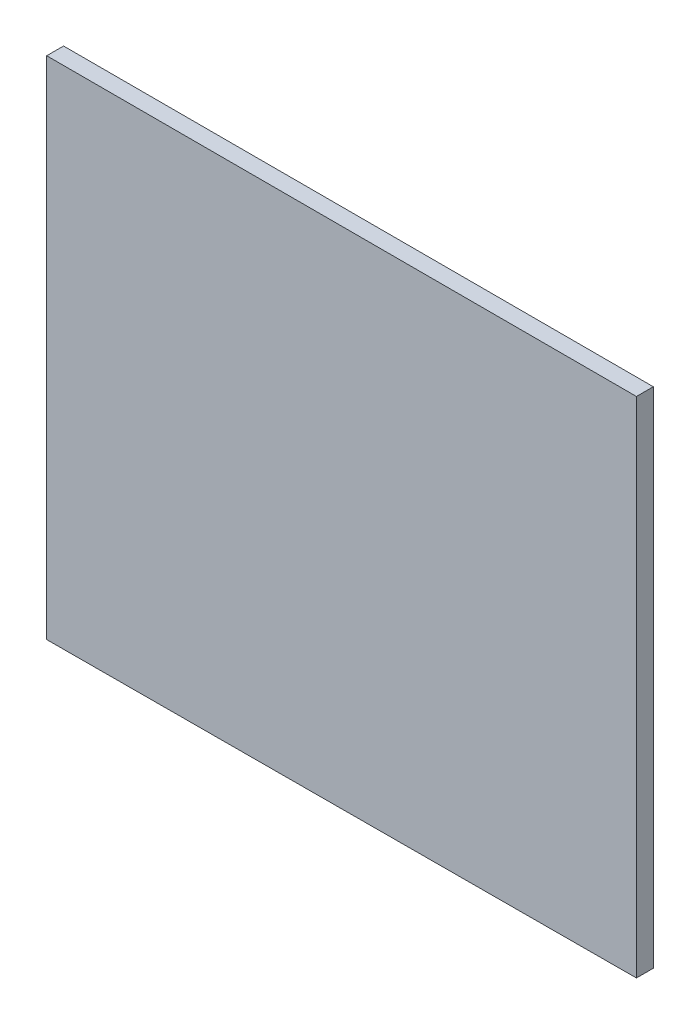
ISO-10303-21;
HEADER;
FILE_DESCRIPTION(('STEP AP214'),'2;1');
FILE_NAME('part.step','',(''),(''),'','','');
FILE_SCHEMA(('AUTOMOTIVE_DESIGN { 1 0 10303 214 1 1 1 1 }'));
ENDSEC;
DATA;
#1=APPLICATION_CONTEXT('core data for automotive mechanical design processes');
#2=APPLICATION_PROTOCOL_DEFINITION('international standard','automotive_design',2000,#1);
#3=PRODUCT_CONTEXT('',#1,'mechanical');
#4=PRODUCT('Part','Part','',(#3));
#5=PRODUCT_RELATED_PRODUCT_CATEGORY('part','',(#4));
#6=PRODUCT_DEFINITION_FORMATION('','',#4);
#7=PRODUCT_DEFINITION_CONTEXT('part definition',#1,'design');
#8=PRODUCT_DEFINITION('design','',#6,#7);
#9=PRODUCT_DEFINITION_SHAPE('','',#8);
#10=(LENGTH_UNIT() NAMED_UNIT(*) SI_UNIT(.MILLI.,.METRE.));
#11=(NAMED_UNIT(*) PLANE_ANGLE_UNIT() SI_UNIT($,.RADIAN.));
#12=(NAMED_UNIT(*) SI_UNIT($,.STERADIAN.) SOLID_ANGLE_UNIT());
#13=UNCERTAINTY_MEASURE_WITH_UNIT(LENGTH_MEASURE(1.E-05),#10,'distance_accuracy_value','');
#14=(GEOMETRIC_REPRESENTATION_CONTEXT(3) GLOBAL_UNCERTAINTY_ASSIGNED_CONTEXT((#13)) GLOBAL_UNIT_ASSIGNED_CONTEXT((#10,
#11,#12)) REPRESENTATION_CONTEXT('',''));
#15=CARTESIAN_POINT('',(0.,0.,0.));
#16=DIRECTION('',(0.,0.,1.));
#17=DIRECTION('',(1.,0.,0.));
#18=AXIS2_PLACEMENT_3D('',#15,#16,#17);
#19=CARTESIAN_POINT('',(42.3997334253943,28.7357408736981,0.1));
#20=DIRECTION('',(-1.,0.,0.));
#21=DIRECTION('',(0.,0.,1.));
#22=AXIS2_PLACEMENT_3D('',#19,#20,#21);
#23=PLANE('',#22);
#24=DIRECTION('',(0.,1.,0.));
#25=VECTOR('',#24,1.);
#26=CARTESIAN_POINT('',(42.3997334253943,28.7357408736981,0.));
#27=LINE('',#26,#25);
#28=CARTESIAN_POINT('',(42.3997334253943,28.7357408736981,0.));
#29=VERTEX_POINT('',#28);
#30=CARTESIAN_POINT('',(42.3997334253943,31.7237007621709,0.));
#31=VERTEX_POINT('',#30);
#32=EDGE_CURVE('E96',#29,#31,#27,.T.);
#33=ORIENTED_EDGE('',*,*,#32,.T.);
#34=DIRECTION('',(0.,0.,-1.));
#35=VECTOR('',#34,1.);
#36=CARTESIAN_POINT('',(42.3997334253943,31.7237007621709,0.1));
#37=LINE('',#36,#35);
#38=CARTESIAN_POINT('',(42.3997334253943,31.7237007621709,0.1));
#39=VERTEX_POINT('',#38);
#40=EDGE_CURVE('E11',#39,#31,#37,.T.);
#41=ORIENTED_EDGE('',*,*,#40,.F.);
#42=DIRECTION('',(0.,1.,0.));
#43=VECTOR('',#42,1.);
#44=CARTESIAN_POINT('',(42.3997334253943,28.7357408736981,0.1));
#45=LINE('',#44,#43);
#46=CARTESIAN_POINT('',(42.3997334253943,28.7357408736981,0.1));
#47=VERTEX_POINT('',#46);
#48=EDGE_CURVE('E84',#47,#39,#45,.T.);
#49=ORIENTED_EDGE('',*,*,#48,.F.);
#50=DIRECTION('',(0.,0.,-1.));
#51=VECTOR('',#50,1.);
#52=CARTESIAN_POINT('',(42.3997334253943,28.7357408736981,0.1));
#53=LINE('',#52,#51);
#54=EDGE_CURVE('E92',#47,#29,#53,.T.);
#55=ORIENTED_EDGE('',*,*,#54,.T.);
#56=EDGE_LOOP('',(#33,#41,#49,#55));
#57=FACE_BOUND('',#56,.T.);
#58=ADVANCED_FACE('F33',(#57),#23,.F.);
#59=CARTESIAN_POINT('',(42.3997334253943,31.7237007621709,0.1));
#60=DIRECTION('',(-0.000366482877308184,-0.999999932845148,0.));
#61=DIRECTION('',(0.999999932845148,-0.000366482877308184,0.));
#62=AXIS2_PLACEMENT_3D('',#59,#60,#61);
#63=PLANE('',#62);
#64=DIRECTION('',(-0.999999932845148,0.000366482877308184,0.));
#65=VECTOR('',#64,1.);
#66=CARTESIAN_POINT('',(42.3997334253943,31.7237007621709,0.));
#67=LINE('',#66,#65);
#68=CARTESIAN_POINT('',(38.9009908822222,31.7249829914912,0.));
#69=VERTEX_POINT('',#68);
#70=EDGE_CURVE('E88',#31,#69,#67,.T.);
#71=ORIENTED_EDGE('',*,*,#70,.T.);
#72=DIRECTION('',(0.,0.,-1.));
#73=VECTOR('',#72,1.);
#74=CARTESIAN_POINT('',(38.9009908822222,31.7249829914912,0.1));
#75=LINE('',#74,#73);
#76=CARTESIAN_POINT('',(38.9009908822222,31.7249829914912,0.1));
#77=VERTEX_POINT('',#76);
#78=EDGE_CURVE('E41',#77,#69,#75,.T.);
#79=ORIENTED_EDGE('',*,*,#78,.F.);
#80=DIRECTION('',(-0.999999932845148,0.000366482877308184,0.));
#81=VECTOR('',#80,1.);
#82=CARTESIAN_POINT('',(42.3997334253943,31.7237007621709,0.1));
#83=LINE('',#82,#81);
#84=EDGE_CURVE('E79',#39,#77,#83,.T.);
#85=ORIENTED_EDGE('',*,*,#84,.F.);
#86=ORIENTED_EDGE('',*,*,#40,.T.);
#87=EDGE_LOOP('',(#71,#79,#85,#86));
#88=FACE_BOUND('',#87,.T.);
#89=ADVANCED_FACE('F87',(#88),#63,.F.);
#90=CARTESIAN_POINT('',(38.9009908822222,31.7249829914912,0.1));
#91=DIRECTION('',(1.,0.,0.));
#92=DIRECTION('',(0.,0.,-1.));
#93=AXIS2_PLACEMENT_3D('',#90,#91,#92);
#94=PLANE('',#93);
#95=DIRECTION('',(0.,-1.,0.));
#96=VECTOR('',#95,1.);
#97=CARTESIAN_POINT('',(38.9009908822222,31.7249829914912,0.));
#98=LINE('',#97,#96);
#99=CARTESIAN_POINT('',(38.9009908822222,28.7249829914912,0.));
#100=VERTEX_POINT('',#99);
#101=EDGE_CURVE('E66',#69,#100,#98,.T.);
#102=ORIENTED_EDGE('',*,*,#101,.T.);
#103=DIRECTION('',(0.,0.,-1.));
#104=VECTOR('',#103,1.);
#105=CARTESIAN_POINT('',(38.9009908822222,28.7249829914912,0.1));
#106=LINE('',#105,#104);
#107=CARTESIAN_POINT('',(38.9009908822222,28.7249829914912,0.1));
#108=VERTEX_POINT('',#107);
#109=EDGE_CURVE('E89',#108,#100,#106,.T.);
#110=ORIENTED_EDGE('',*,*,#109,.F.);
#111=DIRECTION('',(0.,-1.,0.));
#112=VECTOR('',#111,1.);
#113=CARTESIAN_POINT('',(38.9009908822222,31.7249829914912,0.1));
#114=LINE('',#113,#112);
#115=EDGE_CURVE('E82',#77,#108,#114,.T.);
#116=ORIENTED_EDGE('',*,*,#115,.F.);
#117=ORIENTED_EDGE('',*,*,#78,.T.);
#118=EDGE_LOOP('',(#102,#110,#116,#117));
#119=FACE_BOUND('',#118,.T.);
#120=ADVANCED_FACE('F90',(#119),#94,.F.);
#121=CARTESIAN_POINT('',(42.3997334253943,28.7357408736981,0.1));
#122=DIRECTION('',(-0.00307477078417607,0.99999527288114,0.));
#123=DIRECTION('',(-0.99999527288114,-0.00307477078417607,0.));
#124=AXIS2_PLACEMENT_3D('',#121,#122,#123);
#125=PLANE('',#124);
#126=DIRECTION('',(0.99999527288114,0.00307477078417607,0.));
#127=VECTOR('',#126,1.);
#128=CARTESIAN_POINT('',(42.3997334253943,28.7357408736981,0.));
#129=LINE('',#128,#127);
#130=EDGE_CURVE('E72',#100,#29,#129,.T.);
#131=ORIENTED_EDGE('',*,*,#130,.T.);
#132=ORIENTED_EDGE('',*,*,#54,.F.);
#133=DIRECTION('',(0.99999527288114,0.00307477078417607,0.));
#134=VECTOR('',#133,1.);
#135=CARTESIAN_POINT('',(42.3997334253943,28.7357408736981,0.1));
#136=LINE('',#135,#134);
#137=EDGE_CURVE('E49',#108,#47,#136,.T.);
#138=ORIENTED_EDGE('',*,*,#137,.F.);
#139=ORIENTED_EDGE('',*,*,#109,.T.);
#140=EDGE_LOOP('',(#131,#132,#138,#139));
#141=FACE_BOUND('',#140,.T.);
#142=ADVANCED_FACE('F103',(#141),#125,.F.);
#143=CARTESIAN_POINT('',(0.,0.,0.1));
#144=DIRECTION('',(0.,0.,1.));
#145=DIRECTION('',(1.,0.,0.));
#146=AXIS2_PLACEMENT_3D('',#143,#144,#145);
#147=PLANE('',#146);
#148=ORIENTED_EDGE('',*,*,#48,.T.);
#149=ORIENTED_EDGE('',*,*,#84,.T.);
#150=ORIENTED_EDGE('',*,*,#115,.T.);
#151=ORIENTED_EDGE('',*,*,#137,.T.);
#152=EDGE_LOOP('',(#148,#149,#150,#151));
#153=FACE_BOUND('',#152,.T.);
#154=ADVANCED_FACE('F80',(#153),#147,.T.);
#155=CARTESIAN_POINT('',(0.,0.,0.));
#156=DIRECTION('',(0.,0.,1.));
#157=DIRECTION('',(1.,0.,0.));
#158=AXIS2_PLACEMENT_3D('',#155,#156,#157);
#159=PLANE('',#158);
#160=ORIENTED_EDGE('',*,*,#32,.F.);
#161=ORIENTED_EDGE('',*,*,#130,.F.);
#162=ORIENTED_EDGE('',*,*,#101,.F.);
#163=ORIENTED_EDGE('',*,*,#70,.F.);
#164=EDGE_LOOP('',(#160,#161,#162,#163));
#165=FACE_BOUND('',#164,.T.);
#166=ADVANCED_FACE('F106',(#165),#159,.F.);
#167=CLOSED_SHELL('',(#58,#89,#120,#142,#154,#166));
#168=MANIFOLD_SOLID_BREP('B2',#167);
#169=ADVANCED_BREP_SHAPE_REPRESENTATION('',(#18,#168),#14);
#170=SHAPE_DEFINITION_REPRESENTATION(#9,#169);
ENDSEC;
END-ISO-10303-21;
